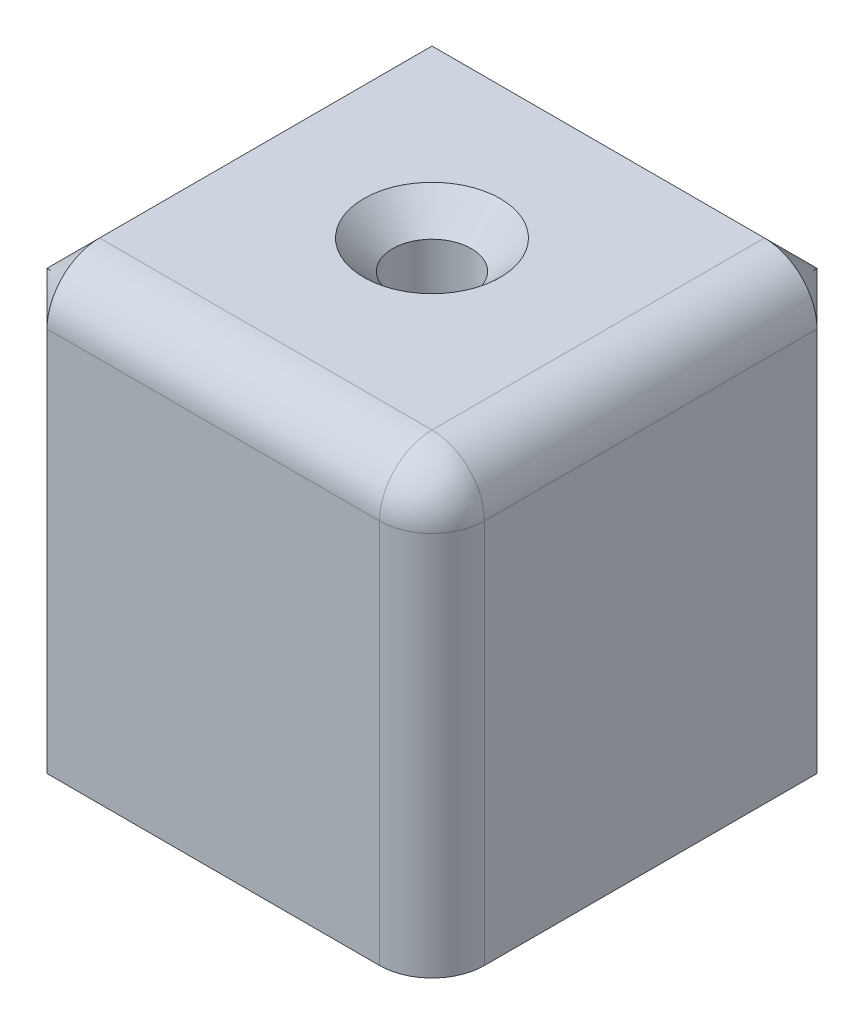
ISO-10303-21;
HEADER;
FILE_DESCRIPTION(('STEP AP214'),'2;1');
FILE_NAME('part.step','',(''),(''),'','','');
FILE_SCHEMA(('AUTOMOTIVE_DESIGN { 1 0 10303 214 1 1 1 1 }'));
ENDSEC;
DATA;
#1=APPLICATION_CONTEXT('core data for automotive mechanical design processes');
#2=APPLICATION_PROTOCOL_DEFINITION('international standard','automotive_design',2000,#1);
#3=PRODUCT_CONTEXT('',#1,'mechanical');
#4=PRODUCT('Part','Part','',(#3));
#5=PRODUCT_RELATED_PRODUCT_CATEGORY('part','',(#4));
#6=PRODUCT_DEFINITION_FORMATION('','',#4);
#7=PRODUCT_DEFINITION_CONTEXT('part definition',#1,'design');
#8=PRODUCT_DEFINITION('design','',#6,#7);
#9=PRODUCT_DEFINITION_SHAPE('','',#8);
#10=(LENGTH_UNIT() NAMED_UNIT(*) SI_UNIT(.MILLI.,.METRE.));
#11=(NAMED_UNIT(*) PLANE_ANGLE_UNIT() SI_UNIT($,.RADIAN.));
#12=(NAMED_UNIT(*) SI_UNIT($,.STERADIAN.) SOLID_ANGLE_UNIT());
#13=UNCERTAINTY_MEASURE_WITH_UNIT(LENGTH_MEASURE(1.E-05),#10,'distance_accuracy_value','');
#14=(GEOMETRIC_REPRESENTATION_CONTEXT(3) GLOBAL_UNCERTAINTY_ASSIGNED_CONTEXT((#13)) GLOBAL_UNIT_ASSIGNED_CONTEXT((#10,
#11,#12)) REPRESENTATION_CONTEXT('',''));
#15=CARTESIAN_POINT('',(0.,0.,0.));
#16=DIRECTION('',(0.,0.,1.));
#17=DIRECTION('',(1.,0.,0.));
#18=AXIS2_PLACEMENT_3D('',#15,#16,#17);
#19=CARTESIAN_POINT('',(-9.5,-8.47969790900301,0.));
#20=CARTESIAN_POINT('',(-12.5,-8.47969790900301,0.));
#21=CARTESIAN_POINT('',(-12.5,-8.47969790900301,3.));
#22=CARTESIAN_POINT('',(-9.5,-8.76169692806561,0.));
#23=CARTESIAN_POINT('',(-12.5,-8.76169692806561,0.));
#24=CARTESIAN_POINT('',(-12.5,-8.76169692806562,3.));
#25=CARTESIAN_POINT('',(-9.5,-9.04369594712822,0.));
#26=CARTESIAN_POINT('',(-12.5,-9.04369594712822,0.));
#27=CARTESIAN_POINT('',(-12.5,-9.04369594712823,3.));
#28=CARTESIAN_POINT('',(-9.5,-9.32569496619083,0.));
#29=CARTESIAN_POINT('',(-12.5,-9.32569496619083,0.));
#30=CARTESIAN_POINT('',(-12.5,-9.32569496619084,3.));
#31=CARTESIAN_POINT('',(-9.48953943439374,-9.42690696218399,7.24372867368769E-05));
#32=CARTESIAN_POINT('',(-12.5,-9.42709208133911,-0.010417495290241));
#33=CARTESIAN_POINT('',(-12.5,-9.33018216260417,3.00000031205753));
#34=CARTESIAN_POINT('',(-9.47985124992175,-9.52479203506867,0.00494718125514182));
#35=CARTESIAN_POINT('',(-12.5,-9.52594805447517,-0.0153073658123277));
#36=CARTESIAN_POINT('',(-12.5,-9.33466674371869,3.00021692229631));
#37=CARTESIAN_POINT('',(-9.46189229384838,-9.71416855919589,0.0228648634690218));
#38=CARTESIAN_POINT('',(-12.5,-9.7188014307804,-0.0154482263440899));
#39=CARTESIAN_POINT('',(-12.5,-9.34359354066983,3.00105485098935));
#40=CARTESIAN_POINT('',(-9.45362004066145,-9.80566663346553,0.0358991964176341));
#41=CARTESIAN_POINT('',(-12.5,-9.8127453594838,-0.0106801698099796));
#42=CARTESIAN_POINT('',(-12.5,-9.34803579613965,3.00167574310597));
#43=CARTESIAN_POINT('',(-9.4383816267823,-9.98230654291523,0.0686253146701818));
#44=CARTESIAN_POINT('',(-12.5,-9.99531690941903,0.00707460901898727));
#45=CARTESIAN_POINT('',(-12.5,-9.35682876611205,3.00329049256568));
#46=CARTESIAN_POINT('',(-9.43140925640774,-10.0674773644363,0.0882841187200889));
#47=CARTESIAN_POINT('',(-12.5,-10.0839188891258,0.0200385099765128));
#48=CARTESIAN_POINT('',(-12.5,-9.36117982283761,3.00428250485803));
#49=CARTESIAN_POINT('',(-9.41860224519067,-10.2324122578531,0.13331419995417));
#50=CARTESIAN_POINT('',(-12.5,-10.2563851308637,0.0531641711522032));
#51=CARTESIAN_POINT('',(-12.5,-9.36978749429849,3.00661510211922));
#52=CARTESIAN_POINT('',(-9.41276792728945,-10.3121747908802,0.158687094218446));
#53=CARTESIAN_POINT('',(-12.5,-10.3402044695952,0.0733373976912513));
#54=CARTESIAN_POINT('',(-12.5,-9.37404408192385,3.00795578577826));
#55=CARTESIAN_POINT('',(-9.39686640180848,-10.5433088920074,0.241987121661314));
#56=CARTESIAN_POINT('',(-12.5,-10.5842211989522,0.143280877189546));
#57=CARTESIAN_POINT('',(-12.5,-9.38660040064144,3.01245396204345));
#58=CARTESIAN_POINT('',(-9.38832645739367,-10.6874027579547,0.307275922455165));
#59=CARTESIAN_POINT('',(-12.5,-10.7372298213756,0.202472526108778));
#60=CARTESIAN_POINT('',(-12.5,-9.39473119649985,3.01609613620847));
#61=CARTESIAN_POINT('',(-9.3747729079442,-10.9587800612676,0.453924288055995));
#62=CARTESIAN_POINT('',(-12.5,-11.026078848291,0.34187353311266));
#63=CARTESIAN_POINT('',(-12.5,-9.41038539285572,3.02451888099659));
#64=CARTESIAN_POINT('',(-9.36976452894758,-11.0860383601159,0.535307442502092));
#65=CARTESIAN_POINT('',(-12.5,-11.1616749460363,0.422077539767204));
#66=CARTESIAN_POINT('',(-12.5,-9.41790787866961,3.02930112476973));
#67=CARTESIAN_POINT('',(-9.36245664026956,-11.3435059937289,0.725897706449514));
#68=CARTESIAN_POINT('',(-12.5,-11.4352042403021,0.614610286311127));
#69=CARTESIAN_POINT('',(-12.5,-9.43328958399548,3.04066416524682));
#70=CARTESIAN_POINT('',(-9.3606769376176,-11.4712880770032,0.837447923194359));
#71=CARTESIAN_POINT('',(-12.5,-11.570171435927,0.729822339856394));
#72=CARTESIAN_POINT('',(-12.5,-9.44102969814305,3.04740721231826));
#73=CARTESIAN_POINT('',(-9.36123097725092,-11.7081819244234,1.07940516808274));
#74=CARTESIAN_POINT('',(-12.5,-11.8174502521945,0.983253222468821));
#75=CARTESIAN_POINT('',(-12.5,-9.45535091045406,3.06203577882318));
#76=CARTESIAN_POINT('',(-9.36356857429083,-11.8172760873709,1.20982976211194));
#77=CARTESIAN_POINT('',(-12.5,-11.9295646584497,1.12130875553381));
#78=CARTESIAN_POINT('',(-12.5,-9.46193091613915,3.0699223625296));
#79=CARTESIAN_POINT('',(-9.3728154974277,-12.0219057877916,1.49911878800925));
#80=CARTESIAN_POINT('',(-12.5,-12.1347775059282,1.42893390114327));
#81=CARTESIAN_POINT('',(-12.5,-9.47407722302292,3.08713963698836));
#82=CARTESIAN_POINT('',(-9.37997743154633,-12.1163163644624,1.65917932435448));
#83=CARTESIAN_POINT('',(-12.5,-12.2263134338627,1.59956484979735));
#84=CARTESIAN_POINT('',(-12.5,-9.4795645225778,3.09652696944427));
#85=CARTESIAN_POINT('',(-9.39482892753993,-12.2387308022238,1.91872338247758));
#86=CARTESIAN_POINT('',(-12.5,-12.3387519034092,1.87546771003543));
#87=CARTESIAN_POINT('',(-12.5,-9.48645819632434,3.11121033615193));
#88=CARTESIAN_POINT('',(-9.40045866714392,-12.2763152212539,2.00840876491992));
#89=CARTESIAN_POINT('',(-12.5,-12.3720173766903,1.97048716535889));
#90=CARTESIAN_POINT('',(-12.5,-9.48853219569135,3.11620137895457));
#91=CARTESIAN_POINT('',(-9.4132331884894,-12.3442187632076,2.1950398091992));
#92=CARTESIAN_POINT('',(-12.5,-12.4291892813532,2.16739891961073));
#93=CARTESIAN_POINT('',(-12.5,-9.49220312258566,3.12635490894819));
#94=CARTESIAN_POINT('',(-9.42037728853445,-12.3745411421351,2.29198219160477));
#95=CARTESIAN_POINT('',(-12.5,-12.4531056768538,2.26922232090818));
#96=CARTESIAN_POINT('',(-12.5,-9.49380026399625,3.13151731811884));
#97=CARTESIAN_POINT('',(-9.43773220107224,-12.4311070744828,2.51125257016201));
#98=CARTESIAN_POINT('',(-12.5,-12.4933328881234,2.49804225767993));
#99=CARTESIAN_POINT('',(-12.5,-9.49670718564421,3.14287329239209));
#100=CARTESIAN_POINT('',(-9.44825860524245,-12.4557645305186,2.63508575793473));
#101=CARTESIAN_POINT('',(-12.5,-12.5076810246976,2.62630886709294));
#102=CARTESIAN_POINT('',(-12.5,-9.49792101194831,3.14909213138865));
#103=CARTESIAN_POINT('',(-9.46605941758451,-12.4815865585337,2.83004859669219));
#104=CARTESIAN_POINT('',(-12.5,-12.5157166243447,2.82635023532406));
#105=CARTESIAN_POINT('',(-12.5,-9.49915574790249,3.15849894228724));
#106=CARTESIAN_POINT('',(-9.47233449047218,-12.4883341948512,2.8966329901389));
#107=CARTESIAN_POINT('',(-12.5,-12.5161502048476,2.89423678614386));
#108=CARTESIAN_POINT('',(-12.5,-9.49946967643882,3.16165038360554));
#109=CARTESIAN_POINT('',(-9.48561035077482,-12.4975340123802,3.03302586984817));
#110=CARTESIAN_POINT('',(-12.5,-12.5119794172163,3.0324449031632));
#111=CARTESIAN_POINT('',(-12.5,-9.49989179870519,3.16796907983258));
#112=CARTESIAN_POINT('',(-9.49261163077137,-12.4999832575736,3.10283652643154));
#113=CARTESIAN_POINT('',(-12.5,-12.5073833072046,3.10274669161309));
#114=CARTESIAN_POINT('',(-12.5,-9.49999985181624,3.17113634406942));
#115=CARTESIAN_POINT('',(-9.49999999281246,-12.5,3.17430496439006));
#116=CARTESIAN_POINT('',(-12.5,-12.5000000060226,3.17430496439006));
#117=CARTESIAN_POINT('',(-12.5,-9.49999999883508,3.1743050307274));
#118=CARTESIAN_POINT('',(-9.4999999952083,-12.5,3.22587662581979));
#119=CARTESIAN_POINT('',(-12.5,-12.5000000040151,3.22587662586098));
#120=CARTESIAN_POINT('',(-12.5,-9.49999999922339,3.22587667004469));
#121=CARTESIAN_POINT('',(-9.49999999760415,-12.5,3.27744828724953));
#122=CARTESIAN_POINT('',(-12.5,-12.5000000020075,3.27744828729071));
#123=CARTESIAN_POINT('',(-12.5,-9.49999999961169,3.27744830936197));
#124=CARTESIAN_POINT('',(-9.5,-12.5,3.32901994867926));
#125=CARTESIAN_POINT('',(-12.5,-12.5,3.32901994867926));
#126=CARTESIAN_POINT('',(-12.5,-9.5,3.32901994867926));
#127=(BOUNDED_SURFACE() B_SPLINE_SURFACE(3,2,((#19,#20,#21),(#22,#23,#24),(#25,#26,#27),(#28,
#29,#30),(#31,#32,#33),(#34,#35,#36),(#37,#38,#39),(#40,#41,#42),(#43,#44,#45),(#46,#47,#48),
(#49,#50,#51),(#52,#53,#54),(#55,#56,#57),(#58,#59,#60),(#61,#62,#63),(#64,#65,#66),(#67,#68,
#69),(#70,#71,#72),(#73,#74,#75),(#76,#77,#78),(#79,#80,#81),(#82,#83,#84),(#85,#86,#87),(#88,
#89,#90),(#91,#92,#93),(#94,#95,#96),(#97,#98,#99),(#100,#101,#102),(#103,#104,#105),(#106,#107,
#108),(#109,#110,#111),(#112,#113,#114),(#115,#116,#117),(#118,#119,#120),(#121,#122,#123),
(#124,#125,#126)),.UNSPECIFIED.,.F.,.F.,.F.) B_SPLINE_SURFACE_WITH_KNOTS((4,3,2,2,2,2,2,2,2,2,2,
2,2,2,2,3,4),(3,3),(0.,0.84599705718783,0.859449631714108,0.872888042681015,0.886260512779001,
0.899636772034856,0.926254813283233,0.952912161918614,0.983573100310417,1.01426275976565,
1.04669898063458,1.06289380158622,1.07908134778662,1.0980391613082,1.10753442287428,
1.11703616766237,1.27175108561424),(0.,1.),
.UNSPECIFIED.) GEOMETRIC_REPRESENTATION_ITEM() RATIONAL_B_SPLINE_SURFACE(((1.,0.707106781186548,
1.),(1.,0.707106781186547,1.),(1.,0.707106781186547,1.),(1.,0.707106781186547,1.),(1.,
0.705873886049674,1.),(1.,0.704729003350521,1.),(1.,0.702602223182961,1.),(1.,0.701620155384453,
1.),(1.,0.69980788627088,1.),(1.,0.698976963408809,1.),(1.,0.6974484137113,1.),(1.,
0.696750824712687,1.),(1.,0.694847250492444,1.),(1.,0.693821613355732,1.),(1.,0.69219177824857,
1.),(1.,0.691588204862266,1.),(1.,0.690707131460237,1.),(1.,0.690492217756871,1.),(1.,
0.690559062343513,1.),(1.,0.690841286070348,1.),(1.,0.691955889739115,1.),(1.,0.692818665237337,
1.),(1.,0.694601911740614,1.),(1.,0.695277179766884,1.),(1.,0.696806612684435,1.),(1.,
0.697660697078571,1.),(1.,0.699730870417562,1.),(1.,0.700983897330734,1.),(1.,0.703095817038027,
1.),(1.,0.703839260193089,1.),(1.,0.7054093387916,1.),(1.,0.706236030690906,1.),(1.,
0.707106780339487,1.),(1.,0.707106780621841,1.),(1.,0.707106780904194,1.),(1.,0.707106781186548,1.))) REPRESENTATION_ITEM('') SURFACE());
#128=CARTESIAN_POINT('',(-9.49999999999999,-9.32569496619084,3.));
#129=DIRECTION('',(0.,1.,0.));
#130=DIRECTION('',(0.,0.,1.));
#131=AXIS2_PLACEMENT_3D('',#128,#129,#130);
#132=CIRCLE('',#131,3.);
#133=CARTESIAN_POINT('',(-9.50000000000001,-9.32569496619084,0.));
#134=VERTEX_POINT('',#133);
#135=CARTESIAN_POINT('',(-12.5,-9.32569496619084,3.));
#136=VERTEX_POINT('',#135);
#137=EDGE_CURVE('E12',#134,#136,#132,.T.);
#138=ORIENTED_EDGE('',*,*,#137,.F.);
#139=CARTESIAN_POINT('',(-9.5,-12.5,3.32901994867926));
#140=CARTESIAN_POINT('',(-9.49999999760415,-12.5,3.27744828724953));
#141=CARTESIAN_POINT('',(-9.4999999952083,-12.5,3.22587662581979));
#142=CARTESIAN_POINT('',(-9.49999999281246,-12.5,3.17430496439006));
#143=CARTESIAN_POINT('',(-9.49261163077137,-12.4999832575736,3.10283652643154));
#144=CARTESIAN_POINT('',(-9.48561035077482,-12.4975340123802,3.03302586984817));
#145=CARTESIAN_POINT('',(-9.47233449047218,-12.4883341948512,2.8966329901389));
#146=CARTESIAN_POINT('',(-9.46605941758451,-12.4815865585337,2.83004859669218));
#147=CARTESIAN_POINT('',(-9.44825860524245,-12.4557645305186,2.63508575793472));
#148=CARTESIAN_POINT('',(-9.43773220107225,-12.4311070744828,2.51125257016201));
#149=CARTESIAN_POINT('',(-9.42037728853445,-12.3745411421351,2.29198219160477));
#150=CARTESIAN_POINT('',(-9.4132331884894,-12.3442187632076,2.1950398091992));
#151=CARTESIAN_POINT('',(-9.40045866714392,-12.2763152212539,2.00840876491992));
#152=CARTESIAN_POINT('',(-9.39482892753993,-12.2387308022238,1.91872338247758));
#153=CARTESIAN_POINT('',(-9.37997743154633,-12.1163163644624,1.65917932435447));
#154=CARTESIAN_POINT('',(-9.3728154974277,-12.0219057877916,1.49911878800925));
#155=CARTESIAN_POINT('',(-9.36356857429083,-11.8172760873709,1.20982976211194));
#156=CARTESIAN_POINT('',(-9.36123097725092,-11.7081819244234,1.07940516808274));
#157=CARTESIAN_POINT('',(-9.3606769376176,-11.4712880770032,0.837447923194358));
#158=CARTESIAN_POINT('',(-9.36245664026956,-11.3435059937289,0.725897706449514));
#159=CARTESIAN_POINT('',(-9.36976452894758,-11.0860383601159,0.535307442502093));
#160=CARTESIAN_POINT('',(-9.3747729079442,-10.9587800612676,0.453924288055995));
#161=CARTESIAN_POINT('',(-9.38832645739367,-10.6874027579547,0.307275922455165));
#162=CARTESIAN_POINT('',(-9.39686640180848,-10.5433088920074,0.241987121661313));
#163=CARTESIAN_POINT('',(-9.41276792728945,-10.3121747908802,0.158687094218446));
#164=CARTESIAN_POINT('',(-9.41860224519067,-10.2324122578531,0.13331419995417));
#165=CARTESIAN_POINT('',(-9.43140925640774,-10.0674773644363,0.088284118720089));
#166=CARTESIAN_POINT('',(-9.4383816267823,-9.98230654291524,0.0686253146701819));
#167=CARTESIAN_POINT('',(-9.45362004066145,-9.80566663346553,0.0358991964176342));
#168=CARTESIAN_POINT('',(-9.46189229384837,-9.71416855919589,0.0228648634690219));
#169=CARTESIAN_POINT('',(-9.47985124992175,-9.52479203506867,0.00494718125514173));
#170=CARTESIAN_POINT('',(-9.48953943439374,-9.42690696218399,7.24372867367737E-05));
#171=CARTESIAN_POINT('',(-9.5,-9.32569496619083,0.));
#172=CARTESIAN_POINT('',(-9.5,-9.04369594712822,0.));
#173=CARTESIAN_POINT('',(-9.5,-8.76169692806561,0.));
#174=CARTESIAN_POINT('',(-9.5,-8.47969790900301,0.));
#175=B_SPLINE_CURVE_WITH_KNOTS('',3,(#139,#140,#141,#142,#143,#144,#145,#146,#147,#148,#149,
#150,#151,#152,#153,#154,#155,#156,#157,#158,#159,#160,#161,#162,#163,#164,#165,#166,#167,#168,
#169,#170,#171,#172,#173,#174),.UNSPECIFIED.,.F.,.F.,(4,3,2,2,2,2,2,2,2,2,2,2,2,2,2,3,4),(0.,
0.154714917951862,0.164216662739959,0.173711924306035,0.192669737827621,0.208857284028019,
0.225052104979655,0.257488325848582,0.288177985303819,0.318838923695622,0.345496272331003,
0.37211431357938,0.385490572835236,0.398863042933222,0.412301453900128,0.425754028426406,
1.27175108561424),.UNSPECIFIED.);
#176=CARTESIAN_POINT('',(-9.50000000000001,-12.5,3.17430503380916));
#177=VERTEX_POINT('',#176);
#178=EDGE_CURVE('E283',#177,#134,#175,.T.);
#179=ORIENTED_EDGE('',*,*,#178,.F.);
#180=CARTESIAN_POINT('',(-9.5,-9.50000000000001,3.17430503380917));
#181=DIRECTION('',(0.,0.,-1.));
#182=DIRECTION('',(-1.,0.,0.));
#183=AXIS2_PLACEMENT_3D('',#180,#181,#182);
#184=CIRCLE('',#183,3.);
#185=CARTESIAN_POINT('',(-12.5,-9.5,3.17430503380917));
#186=VERTEX_POINT('',#185);
#187=EDGE_CURVE('E51',#177,#186,#184,.T.);
#188=ORIENTED_EDGE('',*,*,#187,.T.);
#189=CARTESIAN_POINT('',(-12.5,-8.47969790900301,3.));
#190=CARTESIAN_POINT('',(-12.5,-8.76169692806562,3.));
#191=CARTESIAN_POINT('',(-12.5,-9.04369594712823,3.));
#192=CARTESIAN_POINT('',(-12.5,-9.32569496619084,3.));
#193=CARTESIAN_POINT('',(-12.5,-9.33018216260417,3.00000031205753));
#194=CARTESIAN_POINT('',(-12.5,-9.33466674371869,3.00021692229631));
#195=CARTESIAN_POINT('',(-12.5,-9.34359354066983,3.00105485098935));
#196=CARTESIAN_POINT('',(-12.5,-9.34803579613965,3.00167574310597));
#197=CARTESIAN_POINT('',(-12.5,-9.35682876611205,3.00329049256568));
#198=CARTESIAN_POINT('',(-12.5,-9.36117982283761,3.00428250485803));
#199=CARTESIAN_POINT('',(-12.5,-9.36978749429849,3.00661510211922));
#200=CARTESIAN_POINT('',(-12.5,-9.37404408192385,3.00795578577826));
#201=CARTESIAN_POINT('',(-12.5,-9.38660040064144,3.01245396204345));
#202=CARTESIAN_POINT('',(-12.5,-9.39473119649985,3.01609613620847));
#203=CARTESIAN_POINT('',(-12.5,-9.41038539285572,3.02451888099659));
#204=CARTESIAN_POINT('',(-12.5,-9.41790787866961,3.02930112476973));
#205=CARTESIAN_POINT('',(-12.5,-9.43328958399548,3.04066416524682));
#206=CARTESIAN_POINT('',(-12.5,-9.44102969814305,3.04740721231826));
#207=CARTESIAN_POINT('',(-12.5,-9.45535091045406,3.06203577882318));
#208=CARTESIAN_POINT('',(-12.5,-9.46193091613915,3.0699223625296));
#209=CARTESIAN_POINT('',(-12.5,-9.47407722302292,3.08713963698836));
#210=CARTESIAN_POINT('',(-12.5,-9.4795645225778,3.09652696944427));
#211=CARTESIAN_POINT('',(-12.5,-9.48645819632435,3.11121033615193));
#212=CARTESIAN_POINT('',(-12.5,-9.48853219569135,3.11620137895457));
#213=CARTESIAN_POINT('',(-12.5,-9.49220312258566,3.12635490894819));
#214=CARTESIAN_POINT('',(-12.5,-9.49380026399625,3.13151731811884));
#215=CARTESIAN_POINT('',(-12.5,-9.49670718564421,3.14287329239209));
#216=CARTESIAN_POINT('',(-12.5,-9.49792101194831,3.14909213138865));
#217=CARTESIAN_POINT('',(-12.5,-9.49915574790249,3.15849894228724));
#218=CARTESIAN_POINT('',(-12.5,-9.49946967643882,3.16165038360554));
#219=CARTESIAN_POINT('',(-12.5,-9.49989179870519,3.16796907983258));
#220=CARTESIAN_POINT('',(-12.5,-9.49999985181624,3.17113634406942));
#221=CARTESIAN_POINT('',(-12.5,-9.49999999883508,3.1743050307274));
#222=CARTESIAN_POINT('',(-12.5,-9.49999999922339,3.22587667004469));
#223=CARTESIAN_POINT('',(-12.5,-9.49999999961169,3.27744830936197));
#224=CARTESIAN_POINT('',(-12.5,-9.5,3.32901994867926));
#225=B_SPLINE_CURVE_WITH_KNOTS('',3,(#189,#190,#191,#192,#193,#194,#195,#196,#197,#198,#199,
#200,#201,#202,#203,#204,#205,#206,#207,#208,#209,#210,#211,#212,#213,#214,#215,#216,#217,#218,
#219,#220,#221,#222,#223,#224),.UNSPECIFIED.,.F.,.F.,(4,3,2,2,2,2,2,2,2,2,2,2,2,2,2,3,4),(0.,
0.84599705718783,0.859449631714108,0.872888042681015,0.886260512779001,0.899636772034856,
0.926254813283233,0.952912161918614,0.983573100310417,1.01426275976565,1.04669898063458,
1.06289380158622,1.07908134778662,1.0980391613082,1.10753442287428,1.11703616766237,
1.27175108561424),.UNSPECIFIED.);
#226=EDGE_CURVE('E273',#136,#186,#225,.T.);
#227=ORIENTED_EDGE('',*,*,#226,.F.);
#228=EDGE_LOOP('',(#138,#179,#188,#227));
#229=FACE_BOUND('',#228,.T.);
#230=ADVANCED_FACE('F43',(#229),#127,.T.);
#231=CARTESIAN_POINT('',(-9.5,-9.5,25.));
#232=DIRECTION('',(0.,0.,-1.));
#233=DIRECTION('',(-1.,0.,0.));
#234=AXIS2_PLACEMENT_3D('',#231,#232,#233);
#235=CYLINDRICAL_SURFACE('',#234,3.);
#236=ORIENTED_EDGE('',*,*,#187,.F.);
#237=DIRECTION('',(0.,0.,-1.));
#238=VECTOR('',#237,1.);
#239=CARTESIAN_POINT('',(-9.5,-12.5,25.));
#240=LINE('',#239,#238);
#241=CARTESIAN_POINT('',(-9.49999999999999,-12.5,25.));
#242=VERTEX_POINT('',#241);
#243=EDGE_CURVE('E305',#242,#177,#240,.T.);
#244=ORIENTED_EDGE('',*,*,#243,.F.);
#245=CARTESIAN_POINT('',(-9.5,-9.5,25.));
#246=DIRECTION('',(-0.707106781186547,0.,0.707106781186547));
#247=DIRECTION('',(-0.707106781186548,0.,-0.707106781186548));
#248=AXIS2_PLACEMENT_3D('',#245,#246,#247);
#249=ELLIPSE('',#248,4.24264068711929,3.);
#250=CARTESIAN_POINT('',(-12.5,-9.50000000000001,22.));
#251=VERTEX_POINT('',#250);
#252=EDGE_CURVE('E282',#251,#242,#249,.T.);
#253=ORIENTED_EDGE('',*,*,#252,.F.);
#254=DIRECTION('',(0.,0.,-1.));
#255=VECTOR('',#254,1.);
#256=CARTESIAN_POINT('',(-12.5,-9.5,25.));
#257=LINE('',#256,#255);
#258=EDGE_CURVE('E279',#186,#251,#257,.F.);
#259=ORIENTED_EDGE('',*,*,#258,.F.);
#260=EDGE_LOOP('',(#236,#244,#253,#259));
#261=FACE_BOUND('',#260,.T.);
#262=ADVANCED_FACE('F293',(#261),#235,.T.);
#263=CARTESIAN_POINT('',(-9.5,0.,3.));
#264=DIRECTION('',(0.,1.,0.));
#265=DIRECTION('',(-1.,0.,0.));
#266=AXIS2_PLACEMENT_3D('',#263,#264,#265);
#267=CYLINDRICAL_SURFACE('',#266,3.);
#268=DIRECTION('',(0.,1.,0.));
#269=VECTOR('',#268,1.);
#270=CARTESIAN_POINT('',(-9.5,0.,0.));
#271=LINE('',#270,#269);
#272=CARTESIAN_POINT('',(-9.5,9.49999999999999,0.));
#273=VERTEX_POINT('',#272);
#274=EDGE_CURVE('E290',#134,#273,#271,.T.);
#275=ORIENTED_EDGE('',*,*,#274,.F.);
#276=ORIENTED_EDGE('',*,*,#137,.T.);
#277=DIRECTION('',(0.,1.,0.));
#278=VECTOR('',#277,1.);
#279=CARTESIAN_POINT('',(-12.5,12.5,3.));
#280=LINE('',#279,#278);
#281=CARTESIAN_POINT('',(-12.5,9.49999999999999,3.));
#282=VERTEX_POINT('',#281);
#283=EDGE_CURVE('E312',#282,#136,#280,.F.);
#284=ORIENTED_EDGE('',*,*,#283,.F.);
#285=CARTESIAN_POINT('',(-9.5,12.5,3.));
#286=DIRECTION('',(0.707106781186547,-0.707106781186547,0.));
#287=DIRECTION('',(0.707106781186548,0.707106781186548,0.));
#288=AXIS2_PLACEMENT_3D('',#285,#286,#287);
#289=ELLIPSE('',#288,4.24264068711928,3.);
#290=CARTESIAN_POINT('',(-11.6213203435596,10.3786796564403,0.878679656440356));
#291=VERTEX_POINT('',#290);
#292=EDGE_CURVE('E58',#291,#282,#289,.F.);
#293=ORIENTED_EDGE('',*,*,#292,.F.);
#294=CARTESIAN_POINT('',(-9.5,12.5,3.));
#295=DIRECTION('',(0.,-0.707106781186547,0.707106781186547));
#296=DIRECTION('',(0.,0.707106781186548,0.707106781186548));
#297=AXIS2_PLACEMENT_3D('',#294,#295,#296);
#298=ELLIPSE('',#297,4.24264068711929,3.);
#299=EDGE_CURVE('E62',#273,#291,#298,.F.);
#300=ORIENTED_EDGE('',*,*,#299,.F.);
#301=EDGE_LOOP('',(#275,#276,#284,#293,#300));
#302=FACE_BOUND('',#301,.T.);
#303=ADVANCED_FACE('F45',(#302),#267,.T.);
#304=CARTESIAN_POINT('',(12.5,12.5,25.));
#305=DIRECTION('',(-1.,0.,0.));
#306=DIRECTION('',(0.,-1.,0.));
#307=AXIS2_PLACEMENT_3D('',#304,#305,#306);
#308=PLANE('',#307);
#309=DIRECTION('',(0.,0.,-1.));
#310=VECTOR('',#309,1.);
#311=CARTESIAN_POINT('',(12.5,-12.5,25.));
#312=LINE('',#311,#310);
#313=CARTESIAN_POINT('',(12.5,-12.5,22.));
#314=VERTEX_POINT('',#313);
#315=CARTESIAN_POINT('',(12.5,-12.5,3.00000000000001));
#316=VERTEX_POINT('',#315);
#317=EDGE_CURVE('E138',#314,#316,#312,.T.);
#318=ORIENTED_EDGE('',*,*,#317,.T.);
#319=DIRECTION('',(0.,1.,0.));
#320=VECTOR('',#319,1.);
#321=CARTESIAN_POINT('',(12.5,12.5,3.00000000000001));
#322=LINE('',#321,#320);
#323=CARTESIAN_POINT('',(12.5,9.5,3.00000000000001));
#324=VERTEX_POINT('',#323);
#325=EDGE_CURVE('E181',#316,#324,#322,.T.);
#326=ORIENTED_EDGE('',*,*,#325,.T.);
#327=DIRECTION('',(0.,0.,-1.));
#328=VECTOR('',#327,1.);
#329=CARTESIAN_POINT('',(12.5,9.5,25.));
#330=LINE('',#329,#328);
#331=CARTESIAN_POINT('',(12.5,9.5,22.));
#332=VERTEX_POINT('',#331);
#333=EDGE_CURVE('E155',#324,#332,#330,.F.);
#334=ORIENTED_EDGE('',*,*,#333,.T.);
#335=DIRECTION('',(0.,1.,0.));
#336=VECTOR('',#335,1.);
#337=CARTESIAN_POINT('',(12.5,-12.5,22.));
#338=LINE('',#337,#336);
#339=EDGE_CURVE('E149',#332,#314,#338,.F.);
#340=ORIENTED_EDGE('',*,*,#339,.T.);
#341=EDGE_LOOP('',(#318,#326,#334,#340));
#342=FACE_BOUND('',#341,.T.);
#343=ADVANCED_FACE('F300',(#342),#308,.F.);
#344=CARTESIAN_POINT('',(-12.5,12.5,25.));
#345=DIRECTION('',(0.,-1.,0.));
#346=DIRECTION('',(0.,0.,-1.));
#347=AXIS2_PLACEMENT_3D('',#344,#345,#346);
#348=PLANE('',#347);
#349=CARTESIAN_POINT('',(0.,12.5,12.5));
#350=DIRECTION('',(0.,1.,0.));
#351=DIRECTION('',(-1.,0.,0.));
#352=AXIS2_PLACEMENT_3D('',#349,#350,#351);
#353=CIRCLE('',#352,3.9);
#354=CARTESIAN_POINT('',(-3.9,12.5,12.5));
#355=VERTEX_POINT('',#354);
#356=EDGE_CURVE('E174',#355,#355,#353,.T.);
#357=ORIENTED_EDGE('',*,*,#356,.F.);
#358=EDGE_LOOP('',(#357));
#359=FACE_BOUND('',#358,.T.);
#360=DIRECTION('',(-1.,0.,0.));
#361=VECTOR('',#360,1.);
#362=CARTESIAN_POINT('',(-12.5,12.5,3.00000000000001));
#363=LINE('',#362,#361);
#364=CARTESIAN_POINT('',(9.5,12.5,3.00000000000001));
#365=VERTEX_POINT('',#364);
#366=CARTESIAN_POINT('',(-9.49999999999999,12.5,3.00000000000001));
#367=VERTEX_POINT('',#366);
#368=EDGE_CURVE('E192',#365,#367,#363,.T.);
#369=ORIENTED_EDGE('',*,*,#368,.T.);
#370=DIRECTION('',(0.,0.,1.));
#371=VECTOR('',#370,1.);
#372=CARTESIAN_POINT('',(-9.49999999999999,12.5,25.));
#373=LINE('',#372,#371);
#374=CARTESIAN_POINT('',(-9.49999999999999,12.5,22.));
#375=VERTEX_POINT('',#374);
#376=EDGE_CURVE('E194',#367,#375,#373,.T.);
#377=ORIENTED_EDGE('',*,*,#376,.T.);
#378=DIRECTION('',(-1.,0.,0.));
#379=VECTOR('',#378,1.);
#380=CARTESIAN_POINT('',(12.5,12.5,22.));
#381=LINE('',#380,#379);
#382=CARTESIAN_POINT('',(9.5,12.5,22.));
#383=VERTEX_POINT('',#382);
#384=EDGE_CURVE('E148',#375,#383,#381,.F.);
#385=ORIENTED_EDGE('',*,*,#384,.T.);
#386=DIRECTION('',(0.,0.,-1.));
#387=VECTOR('',#386,1.);
#388=CARTESIAN_POINT('',(9.5,12.5,25.));
#389=LINE('',#388,#387);
#390=EDGE_CURVE('E164',#383,#365,#389,.T.);
#391=ORIENTED_EDGE('',*,*,#390,.T.);
#392=EDGE_LOOP('',(#369,#377,#385,#391));
#393=FACE_BOUND('',#392,.T.);
#394=ADVANCED_FACE('F330',(#359,#393),#348,.F.);
#395=CARTESIAN_POINT('',(-12.5,12.5,25.));
#396=DIRECTION('',(1.,0.,0.));
#397=DIRECTION('',(0.,1.,0.));
#398=AXIS2_PLACEMENT_3D('',#395,#396,#397);
#399=PLANE('',#398);
#400=ORIENTED_EDGE('',*,*,#226,.T.);
#401=ORIENTED_EDGE('',*,*,#258,.T.);
#402=DIRECTION('',(0.,1.,0.));
#403=VECTOR('',#402,1.);
#404=CARTESIAN_POINT('',(-12.5,9.5,22.));
#405=LINE('',#404,#403);
#406=CARTESIAN_POINT('',(-12.5,9.49999999999999,22.));
#407=VERTEX_POINT('',#406);
#408=EDGE_CURVE('E179',#251,#407,#405,.T.);
#409=ORIENTED_EDGE('',*,*,#408,.T.);
#410=DIRECTION('',(0.,0.,-1.));
#411=VECTOR('',#410,1.);
#412=CARTESIAN_POINT('',(-12.5,9.49999999999999,25.));
#413=LINE('',#412,#411);
#414=EDGE_CURVE('E176',#407,#282,#413,.T.);
#415=ORIENTED_EDGE('',*,*,#414,.T.);
#416=ORIENTED_EDGE('',*,*,#283,.T.);
#417=EDGE_LOOP('',(#400,#401,#409,#415,#416));
#418=FACE_BOUND('',#417,.T.);
#419=ADVANCED_FACE('F348',(#418),#399,.F.);
#420=CARTESIAN_POINT('',(-12.5,-12.5,25.));
#421=DIRECTION('',(0.,1.,0.));
#422=DIRECTION('',(0.,0.,1.));
#423=AXIS2_PLACEMENT_3D('',#420,#421,#422);
#424=PLANE('',#423);
#425=CARTESIAN_POINT('',(0.,-12.5,12.5));
#426=DIRECTION('',(0.,1.,0.));
#427=DIRECTION('',(-1.,0.,0.));
#428=AXIS2_PLACEMENT_3D('',#425,#426,#427);
#429=CIRCLE('',#428,2.25);
#430=CARTESIAN_POINT('',(-2.25,-12.5,12.5));
#431=VERTEX_POINT('',#430);
#432=EDGE_CURVE('E139',#431,#431,#429,.T.);
#433=ORIENTED_EDGE('',*,*,#432,.T.);
#434=EDGE_LOOP('',(#433));
#435=FACE_BOUND('',#434,.T.);
#436=DIRECTION('',(1.,0.,0.));
#437=VECTOR('',#436,1.);
#438=CARTESIAN_POINT('',(-12.5,-12.5,25.));
#439=LINE('',#438,#437);
#440=CARTESIAN_POINT('',(9.50000000000001,-12.5,25.));
#441=VERTEX_POINT('',#440);
#442=EDGE_CURVE('E128',#242,#441,#439,.T.);
#443=ORIENTED_EDGE('',*,*,#442,.F.);
#444=ORIENTED_EDGE('',*,*,#243,.T.);
#445=CARTESIAN_POINT('',(-62.5,-12.5,3.));
#446=CARTESIAN_POINT('',(-45.8333333333333,-12.5,3.));
#447=CARTESIAN_POINT('',(-29.1666666666667,-12.5,3.));
#448=CARTESIAN_POINT('',(-12.5,-12.5,3.));
#449=CARTESIAN_POINT('',(-6.99999999999999,-12.5,3.));
#450=CARTESIAN_POINT('',(-1.5,-12.5,5.));
#451=CARTESIAN_POINT('',(4.,-12.5,5.));
#452=CARTESIAN_POINT('',(5.83333333333333,-12.5,5.));
#453=CARTESIAN_POINT('',(7.66666666666667,-12.5,3.));
#454=CARTESIAN_POINT('',(9.5,-12.5,3.));
#455=CARTESIAN_POINT('',(27.1666666666667,-12.5,3.));
#456=CARTESIAN_POINT('',(44.8333333333333,-12.5,3.));
#457=CARTESIAN_POINT('',(62.5,-12.5,3.));
#458=(BOUNDED_CURVE() B_SPLINE_CURVE(3,(#445,#446,#447,#448,#449,#450,#451,#452,#453,#454,#455,
#456,#457),.UNSPECIFIED.,.F.,.F.) B_SPLINE_CURVE_WITH_KNOTS((4,3,3,3,4),(-0.05,0.,0.0165,0.022,
0.075),.UNSPECIFIED.) CURVE() GEOMETRIC_REPRESENTATION_ITEM() RATIONAL_B_SPLINE_CURVE((1.,1.,1.,
1.,1.,1.,1.,1.,1.,1.,1.,1.,1.)) REPRESENTATION_ITEM(''));
#459=EDGE_CURVE('E196',#177,#316,#458,.T.);
#460=ORIENTED_EDGE('',*,*,#459,.T.);
#461=ORIENTED_EDGE('',*,*,#317,.F.);
#462=CARTESIAN_POINT('',(9.50000000000001,-12.5,22.));
#463=DIRECTION('',(0.,1.,0.));
#464=DIRECTION('',(0.,0.,1.));
#465=AXIS2_PLACEMENT_3D('',#462,#463,#464);
#466=CIRCLE('',#465,3.);
#467=EDGE_CURVE('E143',#314,#441,#466,.F.);
#468=ORIENTED_EDGE('',*,*,#467,.T.);
#469=EDGE_LOOP('',(#443,#444,#460,#461,#468));
#470=FACE_BOUND('',#469,.T.);
#471=ADVANCED_FACE('F144',(#435,#470),#424,.F.);
#472=CARTESIAN_POINT('',(0.,0.,25.));
#473=DIRECTION('',(0.,0.,1.));
#474=DIRECTION('',(1.,0.,0.));
#475=AXIS2_PLACEMENT_3D('',#472,#473,#474);
#476=PLANE('',#475);
#477=DIRECTION('',(-1.,0.,0.));
#478=VECTOR('',#477,1.);
#479=CARTESIAN_POINT('',(-12.5,9.5,25.));
#480=LINE('',#479,#478);
#481=CARTESIAN_POINT('',(9.5,9.5,25.));
#482=VERTEX_POINT('',#481);
#483=CARTESIAN_POINT('',(-9.49999999999999,9.5,25.));
#484=VERTEX_POINT('',#483);
#485=EDGE_CURVE('E156',#482,#484,#480,.T.);
#486=ORIENTED_EDGE('',*,*,#485,.T.);
#487=DIRECTION('',(0.,-1.,0.));
#488=VECTOR('',#487,1.);
#489=CARTESIAN_POINT('',(-9.49999999999999,-12.5,25.));
#490=LINE('',#489,#488);
#491=EDGE_CURVE('E135',#484,#242,#490,.T.);
#492=ORIENTED_EDGE('',*,*,#491,.T.);
#493=ORIENTED_EDGE('',*,*,#442,.T.);
#494=DIRECTION('',(0.,1.,0.));
#495=VECTOR('',#494,1.);
#496=CARTESIAN_POINT('',(9.5,12.5,25.));
#497=LINE('',#496,#495);
#498=EDGE_CURVE('E133',#441,#482,#497,.T.);
#499=ORIENTED_EDGE('',*,*,#498,.T.);
#500=EDGE_LOOP('',(#486,#492,#493,#499));
#501=FACE_BOUND('',#500,.T.);
#502=ADVANCED_FACE('F131',(#501),#476,.T.);
#503=CARTESIAN_POINT('',(0.,0.,0.));
#504=DIRECTION('',(0.,0.,1.));
#505=DIRECTION('',(1.,0.,0.));
#506=AXIS2_PLACEMENT_3D('',#503,#504,#505);
#507=PLANE('',#506);
#508=CARTESIAN_POINT('',(-62.5,-9.5,0.));
#509=CARTESIAN_POINT('',(-45.8333333333333,-9.5,0.));
#510=CARTESIAN_POINT('',(-29.1666666666667,-9.5,0.));
#511=CARTESIAN_POINT('',(-12.5,-9.5,0.));
#512=CARTESIAN_POINT('',(-6.99999999999999,-9.5,0.));
#513=CARTESIAN_POINT('',(-1.5,-7.5,0.));
#514=CARTESIAN_POINT('',(4.,-7.5,0.));
#515=CARTESIAN_POINT('',(5.83333333333333,-7.5,0.));
#516=CARTESIAN_POINT('',(7.66666666666667,-9.5,0.));
#517=CARTESIAN_POINT('',(9.5,-9.5,0.));
#518=CARTESIAN_POINT('',(27.1666666666667,-9.5,0.));
#519=CARTESIAN_POINT('',(44.8333333333333,-9.5,0.));
#520=CARTESIAN_POINT('',(62.5,-9.5,0.));
#521=(BOUNDED_CURVE() B_SPLINE_CURVE(3,(#508,#509,#510,#511,#512,#513,#514,#515,#516,#517,#518,
#519,#520),.UNSPECIFIED.,.F.,.F.) B_SPLINE_CURVE_WITH_KNOTS((4,3,3,3,4),(-0.05,0.,0.0165,0.022,
0.075),.UNSPECIFIED.) CURVE() GEOMETRIC_REPRESENTATION_ITEM() RATIONAL_B_SPLINE_CURVE((1.,1.,1.,
1.,1.,1.,1.,1.,1.,1.,1.,1.,1.)) REPRESENTATION_ITEM(''));
#522=CARTESIAN_POINT('',(9.49999999999999,-9.5,0.));
#523=VERTEX_POINT('',#522);
#524=EDGE_CURVE('E224',#523,#134,#521,.F.);
#525=ORIENTED_EDGE('',*,*,#524,.T.);
#526=ORIENTED_EDGE('',*,*,#274,.T.);
#527=DIRECTION('',(1.,0.,0.));
#528=VECTOR('',#527,1.);
#529=CARTESIAN_POINT('',(0.,9.49999999999999,0.));
#530=LINE('',#529,#528);
#531=CARTESIAN_POINT('',(9.5,9.49999999999999,0.));
#532=VERTEX_POINT('',#531);
#533=EDGE_CURVE('E183',#273,#532,#530,.T.);
#534=ORIENTED_EDGE('',*,*,#533,.T.);
#535=DIRECTION('',(0.,-1.,0.));
#536=VECTOR('',#535,1.);
#537=CARTESIAN_POINT('',(9.49999999999999,0.,0.));
#538=LINE('',#537,#536);
#539=EDGE_CURVE('E185',#532,#523,#538,.T.);
#540=ORIENTED_EDGE('',*,*,#539,.T.);
#541=EDGE_LOOP('',(#525,#526,#534,#540));
#542=FACE_BOUND('',#541,.T.);
#543=ADVANCED_FACE('F355',(#542),#507,.F.);
#544=CARTESIAN_POINT('',(0.,12.5,12.5));
#545=DIRECTION('',(0.,1.,0.));
#546=DIRECTION('',(-1.,0.,0.));
#547=AXIS2_PLACEMENT_3D('',#544,#545,#546);
#548=CYLINDRICAL_SURFACE('',#547,2.25);
#549=ORIENTED_EDGE('',*,*,#432,.F.);
#550=EDGE_LOOP('',(#549));
#551=FACE_BOUND('',#550,.T.);
#552=CARTESIAN_POINT('',(0.,10.85,12.5));
#553=DIRECTION('',(0.,1.,0.));
#554=DIRECTION('',(-1.,0.,0.));
#555=AXIS2_PLACEMENT_3D('',#552,#553,#554);
#556=CIRCLE('',#555,2.25);
#557=CARTESIAN_POINT('',(-2.25,10.85,12.5));
#558=VERTEX_POINT('',#557);
#559=EDGE_CURVE('E546',#558,#558,#556,.T.);
#560=ORIENTED_EDGE('',*,*,#559,.T.);
#561=EDGE_LOOP('',(#560));
#562=FACE_BOUND('',#561,.T.);
#563=ADVANCED_FACE('F357',(#551,#562),#548,.F.);
#564=CARTESIAN_POINT('',(0.,12.5,12.5));
#565=DIRECTION('',(0.,1.,0.));
#566=DIRECTION('',(-1.,0.,0.));
#567=AXIS2_PLACEMENT_3D('',#564,#565,#566);
#568=CONICAL_SURFACE('',#567,3.9,0.785398163397444);
#569=ORIENTED_EDGE('',*,*,#559,.F.);
#570=EDGE_LOOP('',(#569));
#571=FACE_BOUND('',#570,.T.);
#572=ORIENTED_EDGE('',*,*,#356,.T.);
#573=EDGE_LOOP('',(#572));
#574=FACE_BOUND('',#573,.T.);
#575=ADVANCED_FACE('F363',(#571,#574),#568,.F.);
#576=CARTESIAN_POINT('',(0.,9.5,22.));
#577=DIRECTION('',(1.,0.,0.));
#578=DIRECTION('',(0.,0.,-1.));
#579=AXIS2_PLACEMENT_3D('',#576,#577,#578);
#580=CYLINDRICAL_SURFACE('',#579,3.);
#581=ORIENTED_EDGE('',*,*,#384,.F.);
#582=CARTESIAN_POINT('',(-9.49999999999999,9.5,22.));
#583=DIRECTION('',(1.,0.,0.));
#584=DIRECTION('',(0.,1.,0.));
#585=AXIS2_PLACEMENT_3D('',#582,#583,#584);
#586=CIRCLE('',#585,3.);
#587=EDGE_CURVE('E188',#375,#484,#586,.T.);
#588=ORIENTED_EDGE('',*,*,#587,.T.);
#589=ORIENTED_EDGE('',*,*,#485,.F.);
#590=CARTESIAN_POINT('',(9.5,9.5,22.));
#591=DIRECTION('',(1.,0.,0.));
#592=DIRECTION('',(0.,0.,-1.));
#593=AXIS2_PLACEMENT_3D('',#590,#591,#592);
#594=CIRCLE('',#593,3.);
#595=EDGE_CURVE('E172',#383,#482,#594,.T.);
#596=ORIENTED_EDGE('',*,*,#595,.F.);
#597=EDGE_LOOP('',(#581,#588,#589,#596));
#598=FACE_BOUND('',#597,.T.);
#599=ADVANCED_FACE('F336',(#598),#580,.T.);
#600=CARTESIAN_POINT('',(9.5,9.5,25.));
#601=DIRECTION('',(0.,0.,-1.));
#602=DIRECTION('',(-1.,0.,0.));
#603=AXIS2_PLACEMENT_3D('',#600,#601,#602);
#604=CYLINDRICAL_SURFACE('',#603,3.);
#605=ORIENTED_EDGE('',*,*,#333,.F.);
#606=CARTESIAN_POINT('',(9.5,9.5,3.00000000000001));
#607=DIRECTION('',(0.,0.,1.));
#608=DIRECTION('',(1.,0.,0.));
#609=AXIS2_PLACEMENT_3D('',#606,#607,#608);
#610=CIRCLE('',#609,3.);
#611=EDGE_CURVE('E190',#324,#365,#610,.T.);
#612=ORIENTED_EDGE('',*,*,#611,.T.);
#613=ORIENTED_EDGE('',*,*,#390,.F.);
#614=CARTESIAN_POINT('',(9.5,9.5,22.));
#615=DIRECTION('',(0.,0.,1.));
#616=DIRECTION('',(1.,0.,0.));
#617=AXIS2_PLACEMENT_3D('',#614,#615,#616);
#618=CIRCLE('',#617,3.);
#619=EDGE_CURVE('E168',#332,#383,#618,.T.);
#620=ORIENTED_EDGE('',*,*,#619,.F.);
#621=EDGE_LOOP('',(#605,#612,#613,#620));
#622=FACE_BOUND('',#621,.T.);
#623=ADVANCED_FACE('F326',(#622),#604,.T.);
#624=CARTESIAN_POINT('',(9.5,9.5,22.));
#625=DIRECTION('',(0.,1.,0.));
#626=DIRECTION('',(0.,0.,1.));
#627=AXIS2_PLACEMENT_3D('',#624,#625,#626);
#628=SPHERICAL_SURFACE('',#627,3.);
#629=ORIENTED_EDGE('',*,*,#619,.T.);
#630=ORIENTED_EDGE('',*,*,#595,.T.);
#631=CARTESIAN_POINT('',(9.5,9.5,22.));
#632=DIRECTION('',(0.,1.,0.));
#633=DIRECTION('',(0.,0.,1.));
#634=AXIS2_PLACEMENT_3D('',#631,#632,#633);
#635=CIRCLE('',#634,3.);
#636=EDGE_CURVE('E153',#332,#482,#635,.F.);
#637=ORIENTED_EDGE('',*,*,#636,.F.);
#638=EDGE_LOOP('',(#629,#630,#637));
#639=FACE_BOUND('',#638,.T.);
#640=ADVANCED_FACE('F381',(#639),#628,.T.);
#641=CARTESIAN_POINT('',(9.5,0.,22.));
#642=DIRECTION('',(0.,-1.,0.));
#643=DIRECTION('',(1.,0.,0.));
#644=AXIS2_PLACEMENT_3D('',#641,#642,#643);
#645=CYLINDRICAL_SURFACE('',#644,3.);
#646=ORIENTED_EDGE('',*,*,#467,.F.);
#647=ORIENTED_EDGE('',*,*,#339,.F.);
#648=ORIENTED_EDGE('',*,*,#636,.T.);
#649=ORIENTED_EDGE('',*,*,#498,.F.);
#650=EDGE_LOOP('',(#646,#647,#648,#649));
#651=FACE_BOUND('',#650,.T.);
#652=ADVANCED_FACE('F151',(#651),#645,.T.);
#653=CARTESIAN_POINT('',(12.5,12.5,3.00000000000001));
#654=DIRECTION('',(-0.707106781186547,0.,0.707106781186547));
#655=DIRECTION('',(0.,1.,0.));
#656=AXIS2_PLACEMENT_3D('',#653,#654,#655);
#657=PLANE('',#656);
#658=ORIENTED_EDGE('',*,*,#325,.F.);
#659=CARTESIAN_POINT('',(12.5,-12.5,3.));
#660=CARTESIAN_POINT('',(12.3848246840476,-12.4999675530652,2.88482468404763));
#661=CARTESIAN_POINT('',(12.2696343442689,-12.493364927239,2.76963434426891));
#662=CARTESIAN_POINT('',(12.0398664520342,-12.4667702249427,2.53986645203417));
#663=CARTESIAN_POINT('',(11.9252900104699,-12.4467590284982,2.42529001046986));
#664=CARTESIAN_POINT('',(11.6966047060221,-12.3928322994094,2.19660470602211));
#665=CARTESIAN_POINT('',(11.5825115912044,-12.3587816221088,2.08251159120439));
#666=CARTESIAN_POINT('',(11.3570308458653,-12.2763328076156,1.85703084586526));
#667=CARTESIAN_POINT('',(11.2456414093248,-12.2279445499743,1.74564140932485));
#668=CARTESIAN_POINT('',(10.9842266176321,-12.0945219288408,1.48422661763206));
#669=CARTESIAN_POINT('',(10.8359229730995,-12.0025524345702,1.33592297309952));
#670=CARTESIAN_POINT('',(10.5512813513003,-11.7878241670909,1.05128135130028));
#671=CARTESIAN_POINT('',(10.4149037018586,-11.6651731591071,0.914903701858602));
#672=CARTESIAN_POINT('',(10.1929626090918,-11.4228014350398,0.692962609091828));
#673=CARTESIAN_POINT('',(10.1033682004769,-11.310492726763,0.603368200476955));
#674=CARTESIAN_POINT('',(9.93771186505843,-11.067245156516,0.437711865058428));
#675=CARTESIAN_POINT('',(9.8616369747289,-10.9363243604601,0.361636974728895));
#676=CARTESIAN_POINT('',(9.74124882628043,-10.6851510032915,0.24124882628043));
#677=CARTESIAN_POINT('',(9.69362387279754,-10.5680857762953,0.193623872797542));
#678=CARTESIAN_POINT('',(9.61270312073602,-10.3245547114124,0.112703120736022));
#679=CARTESIAN_POINT('',(9.57937567414866,-10.1981103704234,0.0793756741486625));
#680=CARTESIAN_POINT('',(9.53652162402583,-9.97609559473113,0.0365216240258246));
#681=CARTESIAN_POINT('',(9.52290809349693,-9.88209048599838,0.0229080934969333));
#682=CARTESIAN_POINT('',(9.5092069828368,-9.73967790932324,0.00920698283680937));
#683=CARTESIAN_POINT('',(9.50575969798992,-9.69188777697948,0.00575969798992499));
#684=CARTESIAN_POINT('',(9.50115421923354,-9.59606917765698,0.00115421923354653));
#685=CARTESIAN_POINT('',(9.49999691038122,-9.54804062571773,-3.08961877529085E-06));
#686=CARTESIAN_POINT('',(9.50000000000001,-9.5,0.));
#687=B_SPLINE_CURVE_WITH_KNOTS('',3,(#659,#660,#661,#662,#663,#664,#665,#666,#667,#668,#669,
#670,#671,#672,#673,#674,#675,#676,#677,#678,#679,#680,#681,#682,#683,#684,#685,#686),
.UNSPECIFIED.,.F.,.F.,(4,2,2,2,2,2,2,2,2,2,2,2,2,4),(0.,0.488547064677985,0.977792260631788,
1.47186117454573,1.96559043054893,2.65030078974065,3.33263914680748,3.83889033431105,
4.34465343984705,4.74824969807786,5.1509479142565,5.43796519695226,5.58198027368866,
5.72605100022214),.UNSPECIFIED.);
#688=EDGE_CURVE('E214',#316,#523,#687,.T.);
#689=ORIENTED_EDGE('',*,*,#688,.T.);
#690=ORIENTED_EDGE('',*,*,#539,.F.);
#691=DIRECTION('',(-0.707106781186547,0.,-0.707106781186547));
#692=VECTOR('',#691,1.);
#693=CARTESIAN_POINT('',(12.5,9.5,3.00000000000001));
#694=LINE('',#693,#692);
#695=EDGE_CURVE('E169',#324,#532,#694,.T.);
#696=ORIENTED_EDGE('',*,*,#695,.F.);
#697=EDGE_LOOP('',(#658,#689,#690,#696));
#698=FACE_BOUND('',#697,.T.);
#699=ADVANCED_FACE('F229',(#698),#657,.F.);
#700=CARTESIAN_POINT('',(9.5,9.5,3.00000000000001));
#701=DIRECTION('',(0.,0.,1.));
#702=DIRECTION('',(1.,0.,0.));
#703=AXIS2_PLACEMENT_3D('',#700,#701,#702);
#704=CONICAL_SURFACE('',#703,3.00000000000001,0.785398163397448);
#705=ORIENTED_EDGE('',*,*,#611,.F.);
#706=ORIENTED_EDGE('',*,*,#695,.T.);
#707=DIRECTION('',(0.,-0.707106781186547,-0.707106781186547));
#708=VECTOR('',#707,1.);
#709=CARTESIAN_POINT('',(9.5,12.5,3.00000000000001));
#710=LINE('',#709,#708);
#711=EDGE_CURVE('E206',#365,#532,#710,.T.);
#712=ORIENTED_EDGE('',*,*,#711,.F.);
#713=EDGE_LOOP('',(#705,#706,#712));
#714=FACE_BOUND('',#713,.T.);
#715=ADVANCED_FACE('F322',(#714),#704,.T.);
#716=CARTESIAN_POINT('',(-12.5,12.5,3.00000000000001));
#717=DIRECTION('',(0.,-0.707106781186547,0.707106781186547));
#718=DIRECTION('',(-1.,0.,0.));
#719=AXIS2_PLACEMENT_3D('',#716,#717,#718);
#720=PLANE('',#719);
#721=ORIENTED_EDGE('',*,*,#533,.F.);
#722=ORIENTED_EDGE('',*,*,#299,.T.);
#723=DIRECTION('',(0.577350269189626,0.577350269189626,0.577350269189626));
#724=VECTOR('',#723,1.);
#725=CARTESIAN_POINT('',(-10.5,11.5,2.00000000000001));
#726=LINE('',#725,#724);
#727=EDGE_CURVE('E203',#367,#291,#726,.F.);
#728=ORIENTED_EDGE('',*,*,#727,.F.);
#729=ORIENTED_EDGE('',*,*,#368,.F.);
#730=ORIENTED_EDGE('',*,*,#711,.T.);
#731=EDGE_LOOP('',(#721,#722,#728,#729,#730));
#732=FACE_BOUND('',#731,.T.);
#733=ADVANCED_FACE('F354',(#732),#720,.F.);
#734=CARTESIAN_POINT('',(-12.5,9.49999999999999,25.));
#735=DIRECTION('',(0.707106781186547,-0.707106781186547,0.));
#736=DIRECTION('',(0.,0.,-1.));
#737=AXIS2_PLACEMENT_3D('',#734,#735,#736);
#738=PLANE('',#737);
#739=ORIENTED_EDGE('',*,*,#727,.T.);
#740=ORIENTED_EDGE('',*,*,#292,.T.);
#741=ORIENTED_EDGE('',*,*,#414,.F.);
#742=DIRECTION('',(-0.707106781186547,-0.707106781186547,0.));
#743=VECTOR('',#742,1.);
#744=CARTESIAN_POINT('',(-9.49999999999999,12.5,22.));
#745=LINE('',#744,#743);
#746=EDGE_CURVE('E200',#375,#407,#745,.T.);
#747=ORIENTED_EDGE('',*,*,#746,.F.);
#748=ORIENTED_EDGE('',*,*,#376,.F.);
#749=EDGE_LOOP('',(#739,#740,#741,#747,#748));
#750=FACE_BOUND('',#749,.T.);
#751=ADVANCED_FACE('F341',(#750),#738,.F.);
#752=CARTESIAN_POINT('',(-9.49999999999999,9.5,22.));
#753=DIRECTION('',(1.,0.,0.));
#754=DIRECTION('',(0.,1.,0.));
#755=AXIS2_PLACEMENT_3D('',#752,#753,#754);
#756=CONICAL_SURFACE('',#755,3.00000000000001,0.785398163397448);
#757=ORIENTED_EDGE('',*,*,#587,.F.);
#758=ORIENTED_EDGE('',*,*,#746,.T.);
#759=DIRECTION('',(-0.707106781186547,0.,-0.707106781186547));
#760=VECTOR('',#759,1.);
#761=CARTESIAN_POINT('',(-9.49999999999999,9.5,25.));
#762=LINE('',#761,#760);
#763=EDGE_CURVE('E197',#484,#407,#762,.T.);
#764=ORIENTED_EDGE('',*,*,#763,.F.);
#765=EDGE_LOOP('',(#757,#758,#764));
#766=FACE_BOUND('',#765,.T.);
#767=ADVANCED_FACE('F344',(#766),#756,.T.);
#768=CARTESIAN_POINT('',(-9.49999999999999,0.,25.));
#769=DIRECTION('',(-0.707106781186547,0.,0.707106781186547));
#770=DIRECTION('',(0.,1.,0.));
#771=AXIS2_PLACEMENT_3D('',#768,#769,#770);
#772=PLANE('',#771);
#773=ORIENTED_EDGE('',*,*,#408,.F.);
#774=ORIENTED_EDGE('',*,*,#252,.T.);
#775=ORIENTED_EDGE('',*,*,#491,.F.);
#776=ORIENTED_EDGE('',*,*,#763,.T.);
#777=EDGE_LOOP('',(#773,#774,#775,#776));
#778=FACE_BOUND('',#777,.T.);
#779=ADVANCED_FACE('F242',(#778),#772,.T.);
#780=CARTESIAN_POINT('',(-17.53,-12.5,3.));
#781=CARTESIAN_POINT('',(-15.8533333333333,-12.5,3.));
#782=CARTESIAN_POINT('',(-14.1766666666667,-12.5,3.));
#783=CARTESIAN_POINT('',(-12.5,-12.5,3.));
#784=CARTESIAN_POINT('',(-6.99999999999999,-12.5,3.));
#785=CARTESIAN_POINT('',(-1.5,-12.5,5.));
#786=CARTESIAN_POINT('',(4.,-12.5,5.));
#787=CARTESIAN_POINT('',(5.83333333333333,-12.5,5.));
#788=CARTESIAN_POINT('',(7.66666666666667,-12.5,3.));
#789=CARTESIAN_POINT('',(9.5,-12.5,3.));
#790=CARTESIAN_POINT('',(12.2266666666667,-12.5,3.));
#791=CARTESIAN_POINT('',(14.9533333333333,-12.5,3.));
#792=CARTESIAN_POINT('',(17.68,-12.5,3.));
#793=CARTESIAN_POINT('',(-17.53,-12.5,0.));
#794=CARTESIAN_POINT('',(-15.8533333333333,-12.5,0.));
#795=CARTESIAN_POINT('',(-14.1766666666667,-12.5,0.));
#796=CARTESIAN_POINT('',(-12.5,-12.5,0.));
#797=CARTESIAN_POINT('',(-6.99999999999999,-12.5,0.));
#798=CARTESIAN_POINT('',(-1.5,-12.5,0.));
#799=CARTESIAN_POINT('',(4.,-12.5,0.));
#800=CARTESIAN_POINT('',(5.83333333333333,-12.5,0.));
#801=CARTESIAN_POINT('',(7.66666666666667,-12.5,0.));
#802=CARTESIAN_POINT('',(9.5,-12.5,0.));
#803=CARTESIAN_POINT('',(12.2266666666667,-12.5,0.));
#804=CARTESIAN_POINT('',(14.9533333333334,-12.5,0.));
#805=CARTESIAN_POINT('',(17.68,-12.5,0.));
#806=CARTESIAN_POINT('',(-17.53,-9.5,0.));
#807=CARTESIAN_POINT('',(-15.8533333333333,-9.5,0.));
#808=CARTESIAN_POINT('',(-14.1766666666667,-9.5,0.));
#809=CARTESIAN_POINT('',(-12.5,-9.5,0.));
#810=CARTESIAN_POINT('',(-6.99999999999999,-9.5,0.));
#811=CARTESIAN_POINT('',(-1.5,-7.5,0.));
#812=CARTESIAN_POINT('',(4.,-7.5,0.));
#813=CARTESIAN_POINT('',(5.83333333333333,-7.5,0.));
#814=CARTESIAN_POINT('',(7.66666666666667,-9.5,0.));
#815=CARTESIAN_POINT('',(9.5,-9.5,0.));
#816=CARTESIAN_POINT('',(12.2266666666667,-9.5,0.));
#817=CARTESIAN_POINT('',(14.9533333333333,-9.5,0.));
#818=CARTESIAN_POINT('',(17.68,-9.5,0.));
#819=(BOUNDED_SURFACE() B_SPLINE_SURFACE(2,3,((#780,#781,#782,#783,#784,#785,#786,#787,#788,
#789,#790,#791,#792),(#793,#794,#795,#796,#797,#798,#799,#800,#801,#802,#803,#804,#805),(#806,
#807,#808,#809,#810,#811,#812,#813,#814,#815,#816,#817,#818)),.UNSPECIFIED.,.F.,.F.,
.F.) B_SPLINE_SURFACE_WITH_KNOTS((3,3),(4,3,3,3,4),(0.,1.),(-0.00503000000000003,0.,0.0165,
0.022,0.03018),.UNSPECIFIED.) GEOMETRIC_REPRESENTATION_ITEM() RATIONAL_B_SPLINE_SURFACE(((1.,1.,
1.,1.,1.,1.,1.,1.,1.,1.,1.,1.,1.),(0.707106781186548,0.707106781186548,0.707106781186548,
0.707106781186548,0.707106781186548,0.707106781186548,0.707106781186548,0.707106781186548,
0.707106781186548,0.707106781186548,0.707106781186547,0.707106781186547,0.707106781186547),(1.,
1.,1.,1.,1.,1.,1.,1.,1.,1.,1.,1.,1.))) REPRESENTATION_ITEM('') SURFACE());
#820=ORIENTED_EDGE('',*,*,#459,.F.);
#821=ORIENTED_EDGE('',*,*,#178,.T.);
#822=ORIENTED_EDGE('',*,*,#524,.F.);
#823=ORIENTED_EDGE('',*,*,#688,.F.);
#824=EDGE_LOOP('',(#820,#821,#822,#823));
#825=FACE_BOUND('',#824,.T.);
#826=ADVANCED_FACE('F233',(#825),#819,.T.);
#827=CLOSED_SHELL('',(#230,#262,#303,#343,#394,#419,#471,#502,#543,#563,#575,#599,#623,#640,
#652,#699,#715,#733,#751,#767,#779,#826));
#828=MANIFOLD_SOLID_BREP('B2',#827);
#829=ADVANCED_BREP_SHAPE_REPRESENTATION('',(#18,#828),#14);
#830=SHAPE_DEFINITION_REPRESENTATION(#9,#829);
ENDSEC;
END-ISO-10303-21;
